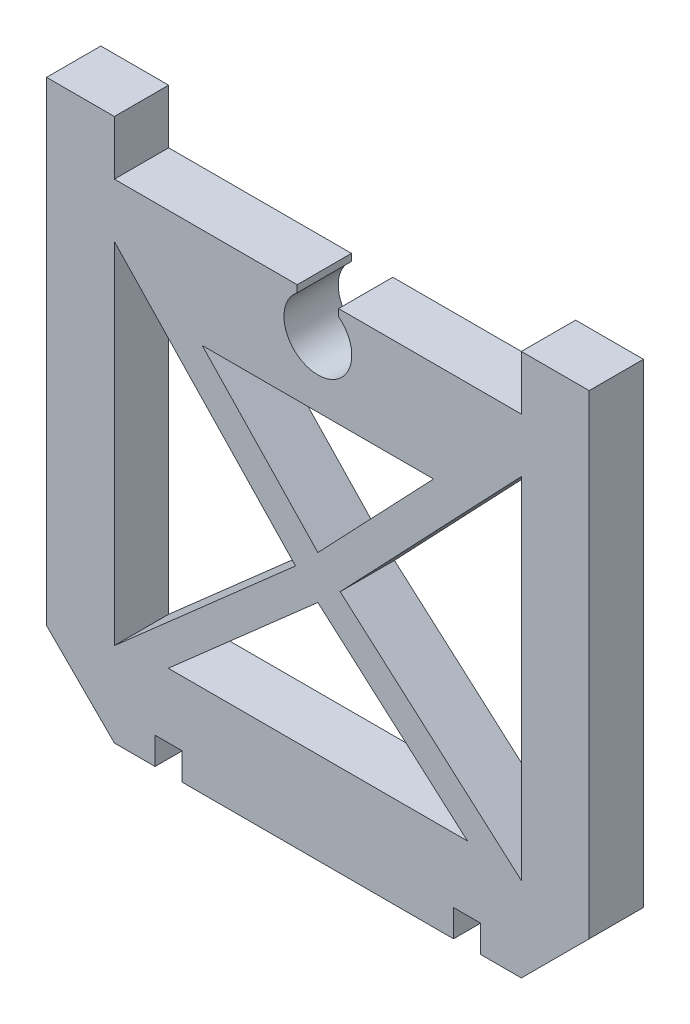
ISO-10303-21;
HEADER;
FILE_DESCRIPTION(('STEP AP214'),'2;1');
FILE_NAME('part.step','',(''),(''),'','','');
FILE_SCHEMA(('AUTOMOTIVE_DESIGN { 1 0 10303 214 1 1 1 1 }'));
ENDSEC;
DATA;
#1=APPLICATION_CONTEXT('core data for automotive mechanical design processes');
#2=APPLICATION_PROTOCOL_DEFINITION('international standard','automotive_design',2000,#1);
#3=PRODUCT_CONTEXT('',#1,'mechanical');
#4=PRODUCT('Part','Part','',(#3));
#5=PRODUCT_RELATED_PRODUCT_CATEGORY('part','',(#4));
#6=PRODUCT_DEFINITION_FORMATION('','',#4);
#7=PRODUCT_DEFINITION_CONTEXT('part definition',#1,'design');
#8=PRODUCT_DEFINITION('design','',#6,#7);
#9=PRODUCT_DEFINITION_SHAPE('','',#8);
#10=(LENGTH_UNIT() NAMED_UNIT(*) SI_UNIT(.MILLI.,.METRE.));
#11=(NAMED_UNIT(*) PLANE_ANGLE_UNIT() SI_UNIT($,.RADIAN.));
#12=(NAMED_UNIT(*) SI_UNIT($,.STERADIAN.) SOLID_ANGLE_UNIT());
#13=UNCERTAINTY_MEASURE_WITH_UNIT(LENGTH_MEASURE(1.E-05),#10,'distance_accuracy_value','');
#14=(GEOMETRIC_REPRESENTATION_CONTEXT(3) GLOBAL_UNCERTAINTY_ASSIGNED_CONTEXT((#13)) GLOBAL_UNIT_ASSIGNED_CONTEXT((#10,
#11,#12)) REPRESENTATION_CONTEXT('',''));
#15=CARTESIAN_POINT('',(0.,0.,0.));
#16=DIRECTION('',(0.,0.,1.));
#17=DIRECTION('',(1.,0.,0.));
#18=AXIS2_PLACEMENT_3D('',#15,#16,#17);
#19=CARTESIAN_POINT('',(8.61119822452986,-8.19508755901242,4.));
#20=DIRECTION('',(-0.724392200156808,0.689388091246128,0.));
#21=DIRECTION('',(-0.689388091246128,-0.724392200156808,0.));
#22=AXIS2_PLACEMENT_3D('',#19,#20,#21);
#23=PLANE('',#22);
#24=DIRECTION('',(0.689388091246128,0.724392200156808,0.));
#25=VECTOR('',#24,1.);
#26=CARTESIAN_POINT('',(8.61119822452986,-8.19508755901242,0.));
#27=LINE('',#26,#25);
#28=CARTESIAN_POINT('',(1.64320660269983,-15.5168832872905,0.));
#29=VERTEX_POINT('',#28);
#30=CARTESIAN_POINT('',(15.,-1.48189040161298,0.));
#31=VERTEX_POINT('',#30);
#32=EDGE_CURVE('E283',#29,#31,#27,.T.);
#33=ORIENTED_EDGE('',*,*,#32,.T.);
#34=DIRECTION('',(0.,0.,-1.));
#35=VECTOR('',#34,1.);
#36=CARTESIAN_POINT('',(15.,-1.48189040161298,4.));
#37=LINE('',#36,#35);
#38=CARTESIAN_POINT('',(15.,-1.48189040161298,4.));
#39=VERTEX_POINT('',#38);
#40=EDGE_CURVE('E11',#39,#31,#37,.T.);
#41=ORIENTED_EDGE('',*,*,#40,.F.);
#42=DIRECTION('',(0.689388091246128,0.724392200156808,0.));
#43=VECTOR('',#42,1.);
#44=CARTESIAN_POINT('',(8.61119822452986,-8.19508755901242,4.));
#45=LINE('',#44,#43);
#46=CARTESIAN_POINT('',(1.64320660269983,-15.5168832872905,4.));
#47=VERTEX_POINT('',#46);
#48=EDGE_CURVE('E274',#47,#39,#45,.T.);
#49=ORIENTED_EDGE('',*,*,#48,.F.);
#50=DIRECTION('',(0.,0.,-1.));
#51=VECTOR('',#50,1.);
#52=CARTESIAN_POINT('',(1.64320660269983,-15.5168832872905,4.));
#53=LINE('',#52,#51);
#54=EDGE_CURVE('E284',#47,#29,#53,.T.);
#55=ORIENTED_EDGE('',*,*,#54,.T.);
#56=EDGE_LOOP('',(#33,#41,#49,#55));
#57=FACE_BOUND('',#56,.T.);
#58=ADVANCED_FACE('F39',(#57),#23,.F.);
#59=CARTESIAN_POINT('',(15.,0.,4.));
#60=DIRECTION('',(1.,0.,0.));
#61=DIRECTION('',(0.,0.,-1.));
#62=AXIS2_PLACEMENT_3D('',#59,#60,#61);
#63=PLANE('',#62);
#64=DIRECTION('',(0.,-1.,0.));
#65=VECTOR('',#64,1.);
#66=CARTESIAN_POINT('',(15.,0.,0.));
#67=LINE('',#66,#65);
#68=CARTESIAN_POINT('',(15.,-27.2797465702889,0.));
#69=VERTEX_POINT('',#68);
#70=EDGE_CURVE('E164',#31,#69,#67,.T.);
#71=ORIENTED_EDGE('',*,*,#70,.T.);
#72=DIRECTION('',(0.,0.,-1.));
#73=VECTOR('',#72,1.);
#74=CARTESIAN_POINT('',(15.,-27.2797465702889,4.));
#75=LINE('',#74,#73);
#76=CARTESIAN_POINT('',(15.,-27.2797465702889,4.));
#77=VERTEX_POINT('',#76);
#78=EDGE_CURVE('E50',#77,#69,#75,.T.);
#79=ORIENTED_EDGE('',*,*,#78,.F.);
#80=DIRECTION('',(0.,-1.,0.));
#81=VECTOR('',#80,1.);
#82=CARTESIAN_POINT('',(15.,0.,4.));
#83=LINE('',#82,#81);
#84=EDGE_CURVE('E269',#39,#77,#83,.T.);
#85=ORIENTED_EDGE('',*,*,#84,.F.);
#86=ORIENTED_EDGE('',*,*,#40,.T.);
#87=EDGE_LOOP('',(#71,#79,#85,#86));
#88=FACE_BOUND('',#87,.T.);
#89=ADVANCED_FACE('F270',(#88),#63,.F.);
#90=CARTESIAN_POINT('',(0.,-4.88041037592957,4.));
#91=DIRECTION('',(0.,-1.,0.));
#92=DIRECTION('',(0.,0.,-1.));
#93=AXIS2_PLACEMENT_3D('',#90,#91,#92);
#94=PLANE('',#93);
#95=DIRECTION('',(-1.,0.,0.));
#96=VECTOR('',#95,1.);
#97=CARTESIAN_POINT('',(0.,-4.88041037592957,0.));
#98=LINE('',#97,#96);
#99=CARTESIAN_POINT('',(8.52612899605196,-4.88041037592957,0.));
#100=VERTEX_POINT('',#99);
#101=CARTESIAN_POINT('',(-8.52612899605196,-4.88041037592957,0.));
#102=VERTEX_POINT('',#101);
#103=EDGE_CURVE('E517',#100,#102,#98,.T.);
#104=ORIENTED_EDGE('',*,*,#103,.F.);
#105=DIRECTION('',(0.,0.,-1.));
#106=VECTOR('',#105,1.);
#107=CARTESIAN_POINT('',(8.52612899605196,-4.88041037592957,4.));
#108=LINE('',#107,#106);
#109=CARTESIAN_POINT('',(8.52612899605196,-4.88041037592957,4.));
#110=VERTEX_POINT('',#109);
#111=EDGE_CURVE('E302',#110,#100,#108,.T.);
#112=ORIENTED_EDGE('',*,*,#111,.F.);
#113=DIRECTION('',(-1.,0.,0.));
#114=VECTOR('',#113,1.);
#115=CARTESIAN_POINT('',(0.,-4.88041037592957,4.));
#116=LINE('',#115,#114);
#117=CARTESIAN_POINT('',(-8.52612899605196,-4.88041037592957,4.));
#118=VERTEX_POINT('',#117);
#119=EDGE_CURVE('E541',#110,#118,#116,.T.);
#120=ORIENTED_EDGE('',*,*,#119,.T.);
#121=DIRECTION('',(0.,0.,-1.));
#122=VECTOR('',#121,1.);
#123=CARTESIAN_POINT('',(-8.52612899605196,-4.88041037592957,4.));
#124=LINE('',#123,#122);
#125=EDGE_CURVE('E305',#118,#102,#124,.T.);
#126=ORIENTED_EDGE('',*,*,#125,.T.);
#127=EDGE_LOOP('',(#104,#112,#120,#126));
#128=FACE_BOUND('',#127,.T.);
#129=ADVANCED_FACE('F745',(#128),#94,.T.);
#130=CARTESIAN_POINT('',(6.91125077717837,-6.5772850403013,4.));
#131=DIRECTION('',(0.724392200156807,-0.689388091246128,0.));
#132=DIRECTION('',(0.689388091246128,0.724392200156807,0.));
#133=AXIS2_PLACEMENT_3D('',#130,#131,#132);
#134=PLANE('',#133);
#135=DIRECTION('',(-0.689388091246128,-0.724392200156807,0.));
#136=VECTOR('',#135,1.);
#137=CARTESIAN_POINT('',(6.91125077717837,-6.5772850403013,0.));
#138=LINE('',#137,#136);
#139=CARTESIAN_POINT('',(0.,-13.8394588722659,0.));
#140=VERTEX_POINT('',#139);
#141=EDGE_CURVE('E293',#100,#140,#138,.T.);
#142=ORIENTED_EDGE('',*,*,#141,.T.);
#143=DIRECTION('',(0.,0.,-1.));
#144=VECTOR('',#143,1.);
#145=CARTESIAN_POINT('',(0.,-13.8394588722659,4.));
#146=LINE('',#145,#144);
#147=CARTESIAN_POINT('',(0.,-13.8394588722659,4.));
#148=VERTEX_POINT('',#147);
#149=EDGE_CURVE('E308',#148,#140,#146,.T.);
#150=ORIENTED_EDGE('',*,*,#149,.F.);
#151=DIRECTION('',(-0.689388091246128,-0.724392200156807,0.));
#152=VECTOR('',#151,1.);
#153=CARTESIAN_POINT('',(6.91125077717837,-6.5772850403013,4.));
#154=LINE('',#153,#152);
#155=EDGE_CURVE('E538',#110,#148,#154,.T.);
#156=ORIENTED_EDGE('',*,*,#155,.F.);
#157=ORIENTED_EDGE('',*,*,#111,.T.);
#158=EDGE_LOOP('',(#142,#150,#156,#157));
#159=FACE_BOUND('',#158,.T.);
#160=ADVANCED_FACE('F525',(#159),#134,.F.);
#161=CARTESIAN_POINT('',(8.44480258001715,-9.5891179408084,4.));
#162=DIRECTION('',(0.6609091935049,-0.750465880597315,0.));
#163=DIRECTION('',(0.750465880597315,0.6609091935049,0.));
#164=AXIS2_PLACEMENT_3D('',#161,#162,#163);
#165=PLANE('',#164);
#166=DIRECTION('',(-0.750465880597315,-0.6609091935049,0.));
#167=VECTOR('',#166,1.);
#168=CARTESIAN_POINT('',(8.44480258001715,-9.5891179408084,0.));
#169=LINE('',#168,#167);
#170=CARTESIAN_POINT('',(0.,-17.0261617915228,0.));
#171=VERTEX_POINT('',#170);
#172=CARTESIAN_POINT('',(-11.0290619170497,-26.7390729380112,0.));
#173=VERTEX_POINT('',#172);
#174=EDGE_CURVE('E505',#171,#173,#169,.T.);
#175=ORIENTED_EDGE('',*,*,#174,.F.);
#176=DIRECTION('',(0.,0.,-1.));
#177=VECTOR('',#176,1.);
#178=CARTESIAN_POINT('',(0.,-17.0261617915228,4.));
#179=LINE('',#178,#177);
#180=CARTESIAN_POINT('',(0.,-17.0261617915228,4.));
#181=VERTEX_POINT('',#180);
#182=EDGE_CURVE('E309',#181,#171,#179,.T.);
#183=ORIENTED_EDGE('',*,*,#182,.F.);
#184=DIRECTION('',(-0.750465880597315,-0.6609091935049,0.));
#185=VECTOR('',#184,1.);
#186=CARTESIAN_POINT('',(8.44480258001715,-9.5891179408084,4.));
#187=LINE('',#186,#185);
#188=CARTESIAN_POINT('',(-11.0290619170497,-26.7390729380112,4.));
#189=VERTEX_POINT('',#188);
#190=EDGE_CURVE('E554',#181,#189,#187,.T.);
#191=ORIENTED_EDGE('',*,*,#190,.T.);
#192=DIRECTION('',(0.,0.,-1.));
#193=VECTOR('',#192,1.);
#194=CARTESIAN_POINT('',(-11.0290619170497,-26.7390729380112,4.));
#195=LINE('',#194,#193);
#196=EDGE_CURVE('E314',#189,#173,#195,.T.);
#197=ORIENTED_EDGE('',*,*,#196,.T.);
#198=EDGE_LOOP('',(#175,#183,#191,#197));
#199=FACE_BOUND('',#198,.T.);
#200=ADVANCED_FACE('F754',(#199),#165,.T.);
#201=CARTESIAN_POINT('',(-8.44480258001715,-9.5891179408084,4.));
#202=DIRECTION('',(0.6609091935049,0.750465880597315,0.));
#203=DIRECTION('',(-0.750465880597315,0.6609091935049,0.));
#204=AXIS2_PLACEMENT_3D('',#201,#202,#203);
#205=PLANE('',#204);
#206=DIRECTION('',(0.750465880597315,-0.6609091935049,0.));
#207=VECTOR('',#206,1.);
#208=CARTESIAN_POINT('',(-8.44480258001715,-9.5891179408084,0.));
#209=LINE('',#208,#207);
#210=CARTESIAN_POINT('',(11.0290619170497,-26.7390729380112,0.));
#211=VERTEX_POINT('',#210);
#212=EDGE_CURVE('E509',#171,#211,#209,.T.);
#213=ORIENTED_EDGE('',*,*,#212,.T.);
#214=DIRECTION('',(0.,0.,-1.));
#215=VECTOR('',#214,1.);
#216=CARTESIAN_POINT('',(11.0290619170497,-26.7390729380112,4.));
#217=LINE('',#216,#215);
#218=CARTESIAN_POINT('',(11.0290619170497,-26.7390729380112,4.));
#219=VERTEX_POINT('',#218);
#220=EDGE_CURVE('E317',#219,#211,#217,.T.);
#221=ORIENTED_EDGE('',*,*,#220,.F.);
#222=DIRECTION('',(0.750465880597315,-0.6609091935049,0.));
#223=VECTOR('',#222,1.);
#224=CARTESIAN_POINT('',(-8.44480258001715,-9.5891179408084,4.));
#225=LINE('',#224,#223);
#226=EDGE_CURVE('E551',#181,#219,#225,.T.);
#227=ORIENTED_EDGE('',*,*,#226,.F.);
#228=ORIENTED_EDGE('',*,*,#182,.T.);
#229=EDGE_LOOP('',(#213,#221,#227,#228));
#230=FACE_BOUND('',#229,.T.);
#231=ADVANCED_FACE('F762',(#230),#205,.F.);
#232=CARTESIAN_POINT('',(-8.61119822452986,-8.19508755901242,4.));
#233=DIRECTION('',(-0.724392200156808,-0.689388091246128,0.));
#234=DIRECTION('',(0.689388091246128,-0.724392200156808,0.));
#235=AXIS2_PLACEMENT_3D('',#232,#233,#234);
#236=PLANE('',#235);
#237=DIRECTION('',(-0.689388091246128,0.724392200156808,0.));
#238=VECTOR('',#237,1.);
#239=CARTESIAN_POINT('',(-8.61119822452986,-8.19508755901242,0.));
#240=LINE('',#239,#238);
#241=CARTESIAN_POINT('',(-1.64320660269983,-15.5168832872905,0.));
#242=VERTEX_POINT('',#241);
#243=CARTESIAN_POINT('',(-15.,-1.48189040161298,0.));
#244=VERTEX_POINT('',#243);
#245=EDGE_CURVE('E493',#242,#244,#240,.T.);
#246=ORIENTED_EDGE('',*,*,#245,.F.);
#247=DIRECTION('',(0.,0.,-1.));
#248=VECTOR('',#247,1.);
#249=CARTESIAN_POINT('',(-1.64320660269983,-15.5168832872905,4.));
#250=LINE('',#249,#248);
#251=CARTESIAN_POINT('',(-1.64320660269983,-15.5168832872905,4.));
#252=VERTEX_POINT('',#251);
#253=EDGE_CURVE('E318',#252,#242,#250,.T.);
#254=ORIENTED_EDGE('',*,*,#253,.F.);
#255=DIRECTION('',(-0.689388091246128,0.724392200156808,0.));
#256=VECTOR('',#255,1.);
#257=CARTESIAN_POINT('',(-8.61119822452986,-8.19508755901242,4.));
#258=LINE('',#257,#256);
#259=CARTESIAN_POINT('',(-15.,-1.48189040161298,4.));
#260=VERTEX_POINT('',#259);
#261=EDGE_CURVE('E566',#252,#260,#258,.T.);
#262=ORIENTED_EDGE('',*,*,#261,.T.);
#263=DIRECTION('',(0.,0.,-1.));
#264=VECTOR('',#263,1.);
#265=CARTESIAN_POINT('',(-15.,-1.48189040161298,4.));
#266=LINE('',#265,#264);
#267=EDGE_CURVE('E323',#260,#244,#266,.T.);
#268=ORIENTED_EDGE('',*,*,#267,.T.);
#269=EDGE_LOOP('',(#246,#254,#262,#268));
#270=FACE_BOUND('',#269,.T.);
#271=ADVANCED_FACE('F765',(#270),#236,.T.);
#272=CARTESIAN_POINT('',(6.97846161179035,-7.92408002517517,4.));
#273=DIRECTION('',(-0.660909193504899,0.750465880597315,0.));
#274=DIRECTION('',(-0.750465880597315,-0.660909193504899,0.));
#275=AXIS2_PLACEMENT_3D('',#272,#273,#274);
#276=PLANE('',#275);
#277=DIRECTION('',(0.750465880597315,0.660909193504899,0.));
#278=VECTOR('',#277,1.);
#279=CARTESIAN_POINT('',(6.97846161179035,-7.92408002517517,0.));
#280=LINE('',#279,#278);
#281=CARTESIAN_POINT('',(-15.,-27.2797465702889,0.));
#282=VERTEX_POINT('',#281);
#283=EDGE_CURVE('E497',#282,#242,#280,.T.);
#284=ORIENTED_EDGE('',*,*,#283,.F.);
#285=DIRECTION('',(0.,0.,-1.));
#286=VECTOR('',#285,1.);
#287=CARTESIAN_POINT('',(-15.,-27.2797465702889,4.));
#288=LINE('',#287,#286);
#289=CARTESIAN_POINT('',(-15.,-27.2797465702889,4.));
#290=VERTEX_POINT('',#289);
#291=EDGE_CURVE('E326',#290,#282,#288,.T.);
#292=ORIENTED_EDGE('',*,*,#291,.F.);
#293=DIRECTION('',(0.750465880597315,0.660909193504899,0.));
#294=VECTOR('',#293,1.);
#295=CARTESIAN_POINT('',(6.97846161179035,-7.92408002517517,4.));
#296=LINE('',#295,#294);
#297=EDGE_CURVE('E562',#290,#252,#296,.T.);
#298=ORIENTED_EDGE('',*,*,#297,.T.);
#299=ORIENTED_EDGE('',*,*,#253,.T.);
#300=EDGE_LOOP('',(#284,#292,#298,#299));
#301=FACE_BOUND('',#300,.T.);
#302=ADVANCED_FACE('F773',(#301),#276,.T.);
#303=CARTESIAN_POINT('',(0.,0.,4.));
#304=DIRECTION('',(0.,0.,-1.));
#305=DIRECTION('',(-1.,0.,0.));
#306=AXIS2_PLACEMENT_3D('',#303,#304,#305);
#307=CYLINDRICAL_SURFACE('',#306,2.5);
#308=CARTESIAN_POINT('',(0.,0.,0.));
#309=DIRECTION('',(0.,0.,1.));
#310=DIRECTION('',(1.,0.,0.));
#311=AXIS2_PLACEMENT_3D('',#308,#309,#310);
#312=CIRCLE('',#311,2.5);
#313=CARTESIAN_POINT('',(-1.52347167103858,1.98217912095323,0.));
#314=VERTEX_POINT('',#313);
#315=CARTESIAN_POINT('',(1.52347167103858,1.98217912095323,0.));
#316=VERTEX_POINT('',#315);
#317=EDGE_CURVE('E415',#314,#316,#312,.T.);
#318=ORIENTED_EDGE('',*,*,#317,.F.);
#319=DIRECTION('',(0.,0.,-1.));
#320=VECTOR('',#319,1.);
#321=CARTESIAN_POINT('',(-1.52347167103858,1.98217912095323,4.));
#322=LINE('',#321,#320);
#323=CARTESIAN_POINT('',(-1.52347167103858,1.98217912095323,4.));
#324=VERTEX_POINT('',#323);
#325=EDGE_CURVE('E43',#324,#314,#322,.T.);
#326=ORIENTED_EDGE('',*,*,#325,.F.);
#327=CARTESIAN_POINT('',(0.,0.,4.));
#328=DIRECTION('',(0.,0.,1.));
#329=DIRECTION('',(1.,0.,0.));
#330=AXIS2_PLACEMENT_3D('',#327,#328,#329);
#331=CIRCLE('',#330,2.5);
#332=CARTESIAN_POINT('',(1.52347167103858,1.98217912095323,4.));
#333=VERTEX_POINT('',#332);
#334=EDGE_CURVE('E299',#324,#333,#331,.T.);
#335=ORIENTED_EDGE('',*,*,#334,.T.);
#336=DIRECTION('',(0.,0.,-1.));
#337=VECTOR('',#336,1.);
#338=CARTESIAN_POINT('',(1.52347167103858,1.98217912095323,4.));
#339=LINE('',#338,#337);
#340=EDGE_CURVE('E331',#333,#316,#339,.T.);
#341=ORIENTED_EDGE('',*,*,#340,.T.);
#342=EDGE_LOOP('',(#318,#326,#335,#341));
#343=FACE_BOUND('',#342,.T.);
#344=ADVANCED_FACE('F41',(#343),#307,.F.);
#345=CARTESIAN_POINT('',(-1.52347167103858,0.,4.));
#346=DIRECTION('',(1.,0.,0.));
#347=DIRECTION('',(0.,0.,-1.));
#348=AXIS2_PLACEMENT_3D('',#345,#346,#347);
#349=PLANE('',#348);
#350=DIRECTION('',(0.,-1.,0.));
#351=VECTOR('',#350,1.);
#352=CARTESIAN_POINT('',(-1.52347167103858,0.,0.));
#353=LINE('',#352,#351);
#354=CARTESIAN_POINT('',(-1.52347167103858,2.5,0.));
#355=VERTEX_POINT('',#354);
#356=EDGE_CURVE('E411',#355,#314,#353,.T.);
#357=ORIENTED_EDGE('',*,*,#356,.F.);
#358=DIRECTION('',(0.,0.,-1.));
#359=VECTOR('',#358,1.);
#360=CARTESIAN_POINT('',(-1.52347167103858,2.5,4.));
#361=LINE('',#360,#359);
#362=CARTESIAN_POINT('',(-1.52347167103858,2.5,4.));
#363=VERTEX_POINT('',#362);
#364=EDGE_CURVE('E400',#363,#355,#361,.T.);
#365=ORIENTED_EDGE('',*,*,#364,.F.);
#366=DIRECTION('',(0.,-1.,0.));
#367=VECTOR('',#366,1.);
#368=CARTESIAN_POINT('',(-1.52347167103858,0.,4.));
#369=LINE('',#368,#367);
#370=EDGE_CURVE('E413',#363,#324,#369,.T.);
#371=ORIENTED_EDGE('',*,*,#370,.T.);
#372=ORIENTED_EDGE('',*,*,#325,.T.);
#373=EDGE_LOOP('',(#357,#365,#371,#372));
#374=FACE_BOUND('',#373,.T.);
#375=ADVANCED_FACE('F409',(#374),#349,.T.);
#376=CARTESIAN_POINT('',(0.,2.5,4.));
#377=DIRECTION('',(0.,-1.,0.));
#378=DIRECTION('',(0.,0.,-1.));
#379=AXIS2_PLACEMENT_3D('',#376,#377,#378);
#380=PLANE('',#379);
#381=DIRECTION('',(-1.,0.,0.));
#382=VECTOR('',#381,1.);
#383=CARTESIAN_POINT('',(0.,2.5,0.));
#384=LINE('',#383,#382);
#385=CARTESIAN_POINT('',(-15.,2.5,0.));
#386=VERTEX_POINT('',#385);
#387=EDGE_CURVE('E425',#355,#386,#384,.T.);
#388=ORIENTED_EDGE('',*,*,#387,.T.);
#389=DIRECTION('',(0.,0.,-1.));
#390=VECTOR('',#389,1.);
#391=CARTESIAN_POINT('',(-15.,2.5,4.));
#392=LINE('',#391,#390);
#393=CARTESIAN_POINT('',(-15.,2.5,4.));
#394=VERTEX_POINT('',#393);
#395=EDGE_CURVE('E397',#394,#386,#392,.T.);
#396=ORIENTED_EDGE('',*,*,#395,.F.);
#397=DIRECTION('',(-1.,0.,0.));
#398=VECTOR('',#397,1.);
#399=CARTESIAN_POINT('',(0.,2.5,4.));
#400=LINE('',#399,#398);
#401=EDGE_CURVE('E631',#363,#394,#400,.T.);
#402=ORIENTED_EDGE('',*,*,#401,.F.);
#403=ORIENTED_EDGE('',*,*,#364,.T.);
#404=EDGE_LOOP('',(#388,#396,#402,#403));
#405=FACE_BOUND('',#404,.T.);
#406=ADVANCED_FACE('F726',(#405),#380,.F.);
#407=CARTESIAN_POINT('',(-15.,0.,4.));
#408=DIRECTION('',(-1.,0.,0.));
#409=DIRECTION('',(0.,0.,1.));
#410=AXIS2_PLACEMENT_3D('',#407,#408,#409);
#411=PLANE('',#410);
#412=DIRECTION('',(0.,1.,0.));
#413=VECTOR('',#412,1.);
#414=CARTESIAN_POINT('',(-15.,0.,0.));
#415=LINE('',#414,#413);
#416=CARTESIAN_POINT('',(-15.,6.5,0.));
#417=VERTEX_POINT('',#416);
#418=EDGE_CURVE('E429',#386,#417,#415,.T.);
#419=ORIENTED_EDGE('',*,*,#418,.T.);
#420=DIRECTION('',(0.,0.,-1.));
#421=VECTOR('',#420,1.);
#422=CARTESIAN_POINT('',(-15.,6.5,4.));
#423=LINE('',#422,#421);
#424=CARTESIAN_POINT('',(-15.,6.5,4.));
#425=VERTEX_POINT('',#424);
#426=EDGE_CURVE('E393',#425,#417,#423,.T.);
#427=ORIENTED_EDGE('',*,*,#426,.F.);
#428=DIRECTION('',(0.,1.,0.));
#429=VECTOR('',#428,1.);
#430=CARTESIAN_POINT('',(-15.,0.,4.));
#431=LINE('',#430,#429);
#432=EDGE_CURVE('E628',#394,#425,#431,.T.);
#433=ORIENTED_EDGE('',*,*,#432,.F.);
#434=ORIENTED_EDGE('',*,*,#395,.T.);
#435=EDGE_LOOP('',(#419,#427,#433,#434));
#436=FACE_BOUND('',#435,.T.);
#437=ADVANCED_FACE('F724',(#436),#411,.F.);
#438=CARTESIAN_POINT('',(0.,6.5,4.));
#439=DIRECTION('',(0.,-1.,0.));
#440=DIRECTION('',(0.,0.,-1.));
#441=AXIS2_PLACEMENT_3D('',#438,#439,#440);
#442=PLANE('',#441);
#443=DIRECTION('',(-1.,0.,0.));
#444=VECTOR('',#443,1.);
#445=CARTESIAN_POINT('',(0.,6.5,0.));
#446=LINE('',#445,#444);
#447=CARTESIAN_POINT('',(-20.,6.5,0.));
#448=VERTEX_POINT('',#447);
#449=EDGE_CURVE('E436',#417,#448,#446,.T.);
#450=ORIENTED_EDGE('',*,*,#449,.T.);
#451=DIRECTION('',(0.,0.,-1.));
#452=VECTOR('',#451,1.);
#453=CARTESIAN_POINT('',(-20.,6.5,4.));
#454=LINE('',#453,#452);
#455=CARTESIAN_POINT('',(-20.,6.5,4.));
#456=VERTEX_POINT('',#455);
#457=EDGE_CURVE('E389',#456,#448,#454,.T.);
#458=ORIENTED_EDGE('',*,*,#457,.F.);
#459=DIRECTION('',(-1.,0.,0.));
#460=VECTOR('',#459,1.);
#461=CARTESIAN_POINT('',(0.,6.5,4.));
#462=LINE('',#461,#460);
#463=EDGE_CURVE('E625',#425,#456,#462,.T.);
#464=ORIENTED_EDGE('',*,*,#463,.F.);
#465=ORIENTED_EDGE('',*,*,#426,.T.);
#466=EDGE_LOOP('',(#450,#458,#464,#465));
#467=FACE_BOUND('',#466,.T.);
#468=ADVANCED_FACE('F720',(#467),#442,.F.);
#469=CARTESIAN_POINT('',(-20.,0.,4.));
#470=DIRECTION('',(1.,0.,0.));
#471=DIRECTION('',(0.,1.,0.));
#472=AXIS2_PLACEMENT_3D('',#469,#470,#471);
#473=PLANE('',#472);
#474=DIRECTION('',(0.,-1.,0.));
#475=VECTOR('',#474,1.);
#476=CARTESIAN_POINT('',(-20.,0.,0.));
#477=LINE('',#476,#475);
#478=CARTESIAN_POINT('',(-20.,-28.5,0.));
#479=VERTEX_POINT('',#478);
#480=EDGE_CURVE('E439',#448,#479,#477,.T.);
#481=ORIENTED_EDGE('',*,*,#480,.T.);
#482=DIRECTION('',(0.,0.,-1.));
#483=VECTOR('',#482,1.);
#484=CARTESIAN_POINT('',(-20.,-28.5,4.));
#485=LINE('',#484,#483);
#486=CARTESIAN_POINT('',(-20.,-28.5,4.));
#487=VERTEX_POINT('',#486);
#488=EDGE_CURVE('E385',#487,#479,#485,.T.);
#489=ORIENTED_EDGE('',*,*,#488,.F.);
#490=DIRECTION('',(0.,-1.,0.));
#491=VECTOR('',#490,1.);
#492=CARTESIAN_POINT('',(-20.,0.,4.));
#493=LINE('',#492,#491);
#494=EDGE_CURVE('E622',#456,#487,#493,.T.);
#495=ORIENTED_EDGE('',*,*,#494,.F.);
#496=ORIENTED_EDGE('',*,*,#457,.T.);
#497=EDGE_LOOP('',(#481,#489,#495,#496));
#498=FACE_BOUND('',#497,.T.);
#499=ADVANCED_FACE('F715',(#498),#473,.F.);
#500=CARTESIAN_POINT('',(-24.25,-24.2500000000001,4.));
#501=DIRECTION('',(0.707106781186546,0.707106781186549,0.));
#502=DIRECTION('',(-0.707106781186549,0.707106781186546,0.));
#503=AXIS2_PLACEMENT_3D('',#500,#501,#502);
#504=PLANE('',#503);
#505=DIRECTION('',(0.707106781186549,-0.707106781186546,0.));
#506=VECTOR('',#505,1.);
#507=CARTESIAN_POINT('',(-24.25,-24.2500000000001,0.));
#508=LINE('',#507,#506);
#509=CARTESIAN_POINT('',(-15.,-33.5,0.));
#510=VERTEX_POINT('',#509);
#511=EDGE_CURVE('E442',#479,#510,#508,.T.);
#512=ORIENTED_EDGE('',*,*,#511,.T.);
#513=DIRECTION('',(0.,0.,-1.));
#514=VECTOR('',#513,1.);
#515=CARTESIAN_POINT('',(-15.,-33.5,4.));
#516=LINE('',#515,#514);
#517=CARTESIAN_POINT('',(-15.,-33.5,4.));
#518=VERTEX_POINT('',#517);
#519=EDGE_CURVE('E381',#518,#510,#516,.T.);
#520=ORIENTED_EDGE('',*,*,#519,.F.);
#521=DIRECTION('',(0.707106781186549,-0.707106781186546,0.));
#522=VECTOR('',#521,1.);
#523=CARTESIAN_POINT('',(-24.25,-24.2500000000001,4.));
#524=LINE('',#523,#522);
#525=EDGE_CURVE('E619',#487,#518,#524,.T.);
#526=ORIENTED_EDGE('',*,*,#525,.F.);
#527=ORIENTED_EDGE('',*,*,#488,.T.);
#528=EDGE_LOOP('',(#512,#520,#526,#527));
#529=FACE_BOUND('',#528,.T.);
#530=ADVANCED_FACE('F710',(#529),#504,.F.);
#531=CARTESIAN_POINT('',(0.,-33.5,4.));
#532=DIRECTION('',(0.,1.,0.));
#533=DIRECTION('',(0.,0.,1.));
#534=AXIS2_PLACEMENT_3D('',#531,#532,#533);
#535=PLANE('',#534);
#536=DIRECTION('',(1.,0.,0.));
#537=VECTOR('',#536,1.);
#538=CARTESIAN_POINT('',(0.,-33.5,0.));
#539=LINE('',#538,#537);
#540=CARTESIAN_POINT('',(-12.,-33.5,0.));
#541=VERTEX_POINT('',#540);
#542=EDGE_CURVE('E445',#510,#541,#539,.T.);
#543=ORIENTED_EDGE('',*,*,#542,.T.);
#544=DIRECTION('',(0.,0.,-1.));
#545=VECTOR('',#544,1.);
#546=CARTESIAN_POINT('',(-12.,-33.5,4.));
#547=LINE('',#546,#545);
#548=CARTESIAN_POINT('',(-12.,-33.5,4.));
#549=VERTEX_POINT('',#548);
#550=EDGE_CURVE('E377',#549,#541,#547,.T.);
#551=ORIENTED_EDGE('',*,*,#550,.F.);
#552=DIRECTION('',(1.,0.,0.));
#553=VECTOR('',#552,1.);
#554=CARTESIAN_POINT('',(0.,-33.5,4.));
#555=LINE('',#554,#553);
#556=EDGE_CURVE('E616',#518,#549,#555,.T.);
#557=ORIENTED_EDGE('',*,*,#556,.F.);
#558=ORIENTED_EDGE('',*,*,#519,.T.);
#559=EDGE_LOOP('',(#543,#551,#557,#558));
#560=FACE_BOUND('',#559,.T.);
#561=ADVANCED_FACE('F706',(#560),#535,.F.);
#562=CARTESIAN_POINT('',(-12.,0.,4.));
#563=DIRECTION('',(-1.,0.,0.));
#564=DIRECTION('',(0.,0.,1.));
#565=AXIS2_PLACEMENT_3D('',#562,#563,#564);
#566=PLANE('',#565);
#567=DIRECTION('',(0.,1.,0.));
#568=VECTOR('',#567,1.);
#569=CARTESIAN_POINT('',(-12.,0.,0.));
#570=LINE('',#569,#568);
#571=CARTESIAN_POINT('',(-12.,-31.5,0.));
#572=VERTEX_POINT('',#571);
#573=EDGE_CURVE('E448',#541,#572,#570,.T.);
#574=ORIENTED_EDGE('',*,*,#573,.T.);
#575=DIRECTION('',(0.,0.,-1.));
#576=VECTOR('',#575,1.);
#577=CARTESIAN_POINT('',(-12.,-31.5,4.));
#578=LINE('',#577,#576);
#579=CARTESIAN_POINT('',(-12.,-31.5,4.));
#580=VERTEX_POINT('',#579);
#581=EDGE_CURVE('E373',#580,#572,#578,.T.);
#582=ORIENTED_EDGE('',*,*,#581,.F.);
#583=DIRECTION('',(0.,1.,0.));
#584=VECTOR('',#583,1.);
#585=CARTESIAN_POINT('',(-12.,0.,4.));
#586=LINE('',#585,#584);
#587=EDGE_CURVE('E613',#549,#580,#586,.T.);
#588=ORIENTED_EDGE('',*,*,#587,.F.);
#589=ORIENTED_EDGE('',*,*,#550,.T.);
#590=EDGE_LOOP('',(#574,#582,#588,#589));
#591=FACE_BOUND('',#590,.T.);
#592=ADVANCED_FACE('F701',(#591),#566,.F.);
#593=CARTESIAN_POINT('',(0.,-31.5,4.));
#594=DIRECTION('',(0.,1.,0.));
#595=DIRECTION('',(0.,0.,1.));
#596=AXIS2_PLACEMENT_3D('',#593,#594,#595);
#597=PLANE('',#596);
#598=DIRECTION('',(1.,0.,0.));
#599=VECTOR('',#598,1.);
#600=CARTESIAN_POINT('',(0.,-31.5,0.));
#601=LINE('',#600,#599);
#602=CARTESIAN_POINT('',(-10.,-31.5,0.));
#603=VERTEX_POINT('',#602);
#604=EDGE_CURVE('E452',#572,#603,#601,.T.);
#605=ORIENTED_EDGE('',*,*,#604,.T.);
#606=DIRECTION('',(0.,0.,-1.));
#607=VECTOR('',#606,1.);
#608=CARTESIAN_POINT('',(-10.,-31.5,4.));
#609=LINE('',#608,#607);
#610=CARTESIAN_POINT('',(-10.,-31.5,4.));
#611=VERTEX_POINT('',#610);
#612=EDGE_CURVE('E369',#611,#603,#609,.T.);
#613=ORIENTED_EDGE('',*,*,#612,.F.);
#614=DIRECTION('',(1.,0.,0.));
#615=VECTOR('',#614,1.);
#616=CARTESIAN_POINT('',(0.,-31.5,4.));
#617=LINE('',#616,#615);
#618=EDGE_CURVE('E610',#580,#611,#617,.T.);
#619=ORIENTED_EDGE('',*,*,#618,.F.);
#620=ORIENTED_EDGE('',*,*,#581,.T.);
#621=EDGE_LOOP('',(#605,#613,#619,#620));
#622=FACE_BOUND('',#621,.T.);
#623=ADVANCED_FACE('F695',(#622),#597,.F.);
#624=CARTESIAN_POINT('',(-10.,0.,4.));
#625=DIRECTION('',(1.,0.,0.));
#626=DIRECTION('',(0.,0.,-1.));
#627=AXIS2_PLACEMENT_3D('',#624,#625,#626);
#628=PLANE('',#627);
#629=DIRECTION('',(0.,-1.,0.));
#630=VECTOR('',#629,1.);
#631=CARTESIAN_POINT('',(-10.,0.,0.));
#632=LINE('',#631,#630);
#633=CARTESIAN_POINT('',(-10.,-33.5,0.));
#634=VERTEX_POINT('',#633);
#635=EDGE_CURVE('E455',#603,#634,#632,.T.);
#636=ORIENTED_EDGE('',*,*,#635,.T.);
#637=DIRECTION('',(0.,0.,-1.));
#638=VECTOR('',#637,1.);
#639=CARTESIAN_POINT('',(-10.,-33.5,4.));
#640=LINE('',#639,#638);
#641=CARTESIAN_POINT('',(-10.,-33.5,4.));
#642=VERTEX_POINT('',#641);
#643=EDGE_CURVE('E365',#642,#634,#640,.T.);
#644=ORIENTED_EDGE('',*,*,#643,.F.);
#645=DIRECTION('',(0.,-1.,0.));
#646=VECTOR('',#645,1.);
#647=CARTESIAN_POINT('',(-10.,0.,4.));
#648=LINE('',#647,#646);
#649=EDGE_CURVE('E607',#611,#642,#648,.T.);
#650=ORIENTED_EDGE('',*,*,#649,.F.);
#651=ORIENTED_EDGE('',*,*,#612,.T.);
#652=EDGE_LOOP('',(#636,#644,#650,#651));
#653=FACE_BOUND('',#652,.T.);
#654=ADVANCED_FACE('F691',(#653),#628,.F.);
#655=CARTESIAN_POINT('',(10.,-33.5,0.));
#656=VERTEX_POINT('',#655);
#657=EDGE_CURVE('E449',#634,#656,#539,.T.);
#658=ORIENTED_EDGE('',*,*,#657,.T.);
#659=DIRECTION('',(0.,0.,-1.));
#660=VECTOR('',#659,1.);
#661=CARTESIAN_POINT('',(10.,-33.5,4.));
#662=LINE('',#661,#660);
#663=CARTESIAN_POINT('',(10.,-33.5,4.));
#664=VERTEX_POINT('',#663);
#665=EDGE_CURVE('E362',#664,#656,#662,.T.);
#666=ORIENTED_EDGE('',*,*,#665,.F.);
#667=EDGE_CURVE('E606',#642,#664,#555,.T.);
#668=ORIENTED_EDGE('',*,*,#667,.F.);
#669=ORIENTED_EDGE('',*,*,#643,.T.);
#670=EDGE_LOOP('',(#658,#666,#668,#669));
#671=FACE_BOUND('',#670,.T.);
#672=ADVANCED_FACE('F686',(#671),#535,.F.);
#673=CARTESIAN_POINT('',(10.,0.,4.));
#674=DIRECTION('',(1.,0.,0.));
#675=DIRECTION('',(0.,0.,-1.));
#676=AXIS2_PLACEMENT_3D('',#673,#674,#675);
#677=PLANE('',#676);
#678=DIRECTION('',(0.,-1.,0.));
#679=VECTOR('',#678,1.);
#680=CARTESIAN_POINT('',(10.,0.,0.));
#681=LINE('',#680,#679);
#682=CARTESIAN_POINT('',(10.,-31.5,0.));
#683=VERTEX_POINT('',#682);
#684=EDGE_CURVE('E458',#683,#656,#681,.T.);
#685=ORIENTED_EDGE('',*,*,#684,.F.);
#686=DIRECTION('',(0.,0.,-1.));
#687=VECTOR('',#686,1.);
#688=CARTESIAN_POINT('',(10.,-31.5,4.));
#689=LINE('',#688,#687);
#690=CARTESIAN_POINT('',(10.,-31.5,4.));
#691=VERTEX_POINT('',#690);
#692=EDGE_CURVE('E359',#691,#683,#689,.T.);
#693=ORIENTED_EDGE('',*,*,#692,.F.);
#694=DIRECTION('',(0.,-1.,0.));
#695=VECTOR('',#694,1.);
#696=CARTESIAN_POINT('',(10.,0.,4.));
#697=LINE('',#696,#695);
#698=EDGE_CURVE('E602',#691,#664,#697,.T.);
#699=ORIENTED_EDGE('',*,*,#698,.T.);
#700=ORIENTED_EDGE('',*,*,#665,.T.);
#701=EDGE_LOOP('',(#685,#693,#699,#700));
#702=FACE_BOUND('',#701,.T.);
#703=ADVANCED_FACE('F678',(#702),#677,.T.);
#704=CARTESIAN_POINT('',(0.,-31.5,4.));
#705=DIRECTION('',(0.,-1.,0.));
#706=DIRECTION('',(0.,0.,-1.));
#707=AXIS2_PLACEMENT_3D('',#704,#705,#706);
#708=PLANE('',#707);
#709=DIRECTION('',(-1.,0.,0.));
#710=VECTOR('',#709,1.);
#711=CARTESIAN_POINT('',(0.,-31.5,0.));
#712=LINE('',#711,#710);
#713=CARTESIAN_POINT('',(12.,-31.5,0.));
#714=VERTEX_POINT('',#713);
#715=EDGE_CURVE('E462',#714,#683,#712,.T.);
#716=ORIENTED_EDGE('',*,*,#715,.F.);
#717=DIRECTION('',(0.,0.,-1.));
#718=VECTOR('',#717,1.);
#719=CARTESIAN_POINT('',(12.,-31.5,4.));
#720=LINE('',#719,#718);
#721=CARTESIAN_POINT('',(12.,-31.5,4.));
#722=VERTEX_POINT('',#721);
#723=EDGE_CURVE('E356',#722,#714,#720,.T.);
#724=ORIENTED_EDGE('',*,*,#723,.F.);
#725=DIRECTION('',(-1.,0.,0.));
#726=VECTOR('',#725,1.);
#727=CARTESIAN_POINT('',(0.,-31.5,4.));
#728=LINE('',#727,#726);
#729=EDGE_CURVE('E598',#722,#691,#728,.T.);
#730=ORIENTED_EDGE('',*,*,#729,.T.);
#731=ORIENTED_EDGE('',*,*,#692,.T.);
#732=EDGE_LOOP('',(#716,#724,#730,#731));
#733=FACE_BOUND('',#732,.T.);
#734=ADVANCED_FACE('F674',(#733),#708,.T.);
#735=CARTESIAN_POINT('',(12.,0.,4.));
#736=DIRECTION('',(-1.,0.,0.));
#737=DIRECTION('',(0.,0.,1.));
#738=AXIS2_PLACEMENT_3D('',#735,#736,#737);
#739=PLANE('',#738);
#740=DIRECTION('',(0.,1.,0.));
#741=VECTOR('',#740,1.);
#742=CARTESIAN_POINT('',(12.,0.,0.));
#743=LINE('',#742,#741);
#744=CARTESIAN_POINT('',(12.,-33.5,0.));
#745=VERTEX_POINT('',#744);
#746=EDGE_CURVE('E466',#745,#714,#743,.T.);
#747=ORIENTED_EDGE('',*,*,#746,.F.);
#748=DIRECTION('',(0.,0.,-1.));
#749=VECTOR('',#748,1.);
#750=CARTESIAN_POINT('',(12.,-33.5,4.));
#751=LINE('',#750,#749);
#752=CARTESIAN_POINT('',(12.,-33.5,4.));
#753=VERTEX_POINT('',#752);
#754=EDGE_CURVE('E353',#753,#745,#751,.T.);
#755=ORIENTED_EDGE('',*,*,#754,.F.);
#756=DIRECTION('',(0.,1.,0.));
#757=VECTOR('',#756,1.);
#758=CARTESIAN_POINT('',(12.,0.,4.));
#759=LINE('',#758,#757);
#760=EDGE_CURVE('E594',#753,#722,#759,.T.);
#761=ORIENTED_EDGE('',*,*,#760,.T.);
#762=ORIENTED_EDGE('',*,*,#723,.T.);
#763=EDGE_LOOP('',(#747,#755,#761,#762));
#764=FACE_BOUND('',#763,.T.);
#765=ADVANCED_FACE('F670',(#764),#739,.T.);
#766=CARTESIAN_POINT('',(0.,-33.5,4.));
#767=DIRECTION('',(0.,-1.,0.));
#768=DIRECTION('',(0.,0.,-1.));
#769=AXIS2_PLACEMENT_3D('',#766,#767,#768);
#770=PLANE('',#769);
#771=DIRECTION('',(-1.,0.,0.));
#772=VECTOR('',#771,1.);
#773=CARTESIAN_POINT('',(0.,-33.5,0.));
#774=LINE('',#773,#772);
#775=CARTESIAN_POINT('',(15.,-33.5,0.));
#776=VERTEX_POINT('',#775);
#777=EDGE_CURVE('E470',#776,#745,#774,.T.);
#778=ORIENTED_EDGE('',*,*,#777,.F.);
#779=DIRECTION('',(0.,0.,-1.));
#780=VECTOR('',#779,1.);
#781=CARTESIAN_POINT('',(15.,-33.5,4.));
#782=LINE('',#781,#780);
#783=CARTESIAN_POINT('',(15.,-33.5,4.));
#784=VERTEX_POINT('',#783);
#785=EDGE_CURVE('E350',#784,#776,#782,.T.);
#786=ORIENTED_EDGE('',*,*,#785,.F.);
#787=DIRECTION('',(-1.,0.,0.));
#788=VECTOR('',#787,1.);
#789=CARTESIAN_POINT('',(0.,-33.5,4.));
#790=LINE('',#789,#788);
#791=EDGE_CURVE('E590',#784,#753,#790,.T.);
#792=ORIENTED_EDGE('',*,*,#791,.T.);
#793=ORIENTED_EDGE('',*,*,#754,.T.);
#794=EDGE_LOOP('',(#778,#786,#792,#793));
#795=FACE_BOUND('',#794,.T.);
#796=ADVANCED_FACE('F666',(#795),#770,.T.);
#797=CARTESIAN_POINT('',(24.25,-24.2500000000001,4.));
#798=DIRECTION('',(0.707106781186546,-0.707106781186549,0.));
#799=DIRECTION('',(0.707106781186549,0.707106781186546,0.));
#800=AXIS2_PLACEMENT_3D('',#797,#798,#799);
#801=PLANE('',#800);
#802=DIRECTION('',(-0.707106781186549,-0.707106781186546,0.));
#803=VECTOR('',#802,1.);
#804=CARTESIAN_POINT('',(24.25,-24.2500000000001,0.));
#805=LINE('',#804,#803);
#806=CARTESIAN_POINT('',(20.,-28.5,0.));
#807=VERTEX_POINT('',#806);
#808=EDGE_CURVE('E474',#807,#776,#805,.T.);
#809=ORIENTED_EDGE('',*,*,#808,.F.);
#810=DIRECTION('',(0.,0.,-1.));
#811=VECTOR('',#810,1.);
#812=CARTESIAN_POINT('',(20.,-28.5,4.));
#813=LINE('',#812,#811);
#814=CARTESIAN_POINT('',(20.,-28.5,4.));
#815=VERTEX_POINT('',#814);
#816=EDGE_CURVE('E347',#815,#807,#813,.T.);
#817=ORIENTED_EDGE('',*,*,#816,.F.);
#818=DIRECTION('',(-0.707106781186549,-0.707106781186546,0.));
#819=VECTOR('',#818,1.);
#820=CARTESIAN_POINT('',(24.25,-24.2500000000001,4.));
#821=LINE('',#820,#819);
#822=EDGE_CURVE('E586',#815,#784,#821,.T.);
#823=ORIENTED_EDGE('',*,*,#822,.T.);
#824=ORIENTED_EDGE('',*,*,#785,.T.);
#825=EDGE_LOOP('',(#809,#817,#823,#824));
#826=FACE_BOUND('',#825,.T.);
#827=ADVANCED_FACE('F662',(#826),#801,.T.);
#828=CARTESIAN_POINT('',(20.,0.,4.));
#829=DIRECTION('',(1.,0.,0.));
#830=DIRECTION('',(0.,1.,0.));
#831=AXIS2_PLACEMENT_3D('',#828,#829,#830);
#832=PLANE('',#831);
#833=DIRECTION('',(0.,-1.,0.));
#834=VECTOR('',#833,1.);
#835=CARTESIAN_POINT('',(20.,0.,0.));
#836=LINE('',#835,#834);
#837=CARTESIAN_POINT('',(20.,6.5,0.));
#838=VERTEX_POINT('',#837);
#839=EDGE_CURVE('E478',#838,#807,#836,.T.);
#840=ORIENTED_EDGE('',*,*,#839,.F.);
#841=DIRECTION('',(0.,0.,-1.));
#842=VECTOR('',#841,1.);
#843=CARTESIAN_POINT('',(20.,6.5,4.));
#844=LINE('',#843,#842);
#845=CARTESIAN_POINT('',(20.,6.5,4.));
#846=VERTEX_POINT('',#845);
#847=EDGE_CURVE('E344',#846,#838,#844,.T.);
#848=ORIENTED_EDGE('',*,*,#847,.F.);
#849=DIRECTION('',(0.,-1.,0.));
#850=VECTOR('',#849,1.);
#851=CARTESIAN_POINT('',(20.,0.,4.));
#852=LINE('',#851,#850);
#853=EDGE_CURVE('E582',#846,#815,#852,.T.);
#854=ORIENTED_EDGE('',*,*,#853,.T.);
#855=ORIENTED_EDGE('',*,*,#816,.T.);
#856=EDGE_LOOP('',(#840,#848,#854,#855));
#857=FACE_BOUND('',#856,.T.);
#858=ADVANCED_FACE('F658',(#857),#832,.T.);
#859=CARTESIAN_POINT('',(0.,6.5,4.));
#860=DIRECTION('',(0.,1.,0.));
#861=DIRECTION('',(0.,0.,1.));
#862=AXIS2_PLACEMENT_3D('',#859,#860,#861);
#863=PLANE('',#862);
#864=DIRECTION('',(1.,0.,0.));
#865=VECTOR('',#864,1.);
#866=CARTESIAN_POINT('',(0.,6.5,0.));
#867=LINE('',#866,#865);
#868=CARTESIAN_POINT('',(15.,6.5,0.));
#869=VERTEX_POINT('',#868);
#870=EDGE_CURVE('E482',#869,#838,#867,.T.);
#871=ORIENTED_EDGE('',*,*,#870,.F.);
#872=DIRECTION('',(0.,0.,-1.));
#873=VECTOR('',#872,1.);
#874=CARTESIAN_POINT('',(15.,6.5,4.));
#875=LINE('',#874,#873);
#876=CARTESIAN_POINT('',(15.,6.5,4.));
#877=VERTEX_POINT('',#876);
#878=EDGE_CURVE('E341',#877,#869,#875,.T.);
#879=ORIENTED_EDGE('',*,*,#878,.F.);
#880=DIRECTION('',(1.,0.,0.));
#881=VECTOR('',#880,1.);
#882=CARTESIAN_POINT('',(0.,6.5,4.));
#883=LINE('',#882,#881);
#884=EDGE_CURVE('E578',#877,#846,#883,.T.);
#885=ORIENTED_EDGE('',*,*,#884,.T.);
#886=ORIENTED_EDGE('',*,*,#847,.T.);
#887=EDGE_LOOP('',(#871,#879,#885,#886));
#888=FACE_BOUND('',#887,.T.);
#889=ADVANCED_FACE('F654',(#888),#863,.T.);
#890=CARTESIAN_POINT('',(15.,0.,4.));
#891=DIRECTION('',(-1.,0.,0.));
#892=DIRECTION('',(0.,0.,1.));
#893=AXIS2_PLACEMENT_3D('',#890,#891,#892);
#894=PLANE('',#893);
#895=DIRECTION('',(0.,1.,0.));
#896=VECTOR('',#895,1.);
#897=CARTESIAN_POINT('',(15.,0.,0.));
#898=LINE('',#897,#896);
#899=CARTESIAN_POINT('',(15.,2.5,0.));
#900=VERTEX_POINT('',#899);
#901=EDGE_CURVE('E486',#900,#869,#898,.T.);
#902=ORIENTED_EDGE('',*,*,#901,.F.);
#903=DIRECTION('',(0.,0.,-1.));
#904=VECTOR('',#903,1.);
#905=CARTESIAN_POINT('',(15.,2.5,4.));
#906=LINE('',#905,#904);
#907=CARTESIAN_POINT('',(15.,2.5,4.));
#908=VERTEX_POINT('',#907);
#909=EDGE_CURVE('E338',#908,#900,#906,.T.);
#910=ORIENTED_EDGE('',*,*,#909,.F.);
#911=DIRECTION('',(0.,1.,0.));
#912=VECTOR('',#911,1.);
#913=CARTESIAN_POINT('',(15.,0.,4.));
#914=LINE('',#913,#912);
#915=EDGE_CURVE('E574',#908,#877,#914,.T.);
#916=ORIENTED_EDGE('',*,*,#915,.T.);
#917=ORIENTED_EDGE('',*,*,#878,.T.);
#918=EDGE_LOOP('',(#902,#910,#916,#917));
#919=FACE_BOUND('',#918,.T.);
#920=ADVANCED_FACE('F650',(#919),#894,.T.);
#921=CARTESIAN_POINT('',(1.52347167103858,2.5,0.));
#922=VERTEX_POINT('',#921);
#923=EDGE_CURVE('E431',#900,#922,#384,.T.);
#924=ORIENTED_EDGE('',*,*,#923,.T.);
#925=DIRECTION('',(0.,0.,-1.));
#926=VECTOR('',#925,1.);
#927=CARTESIAN_POINT('',(1.52347167103858,2.5,4.));
#928=LINE('',#927,#926);
#929=CARTESIAN_POINT('',(1.52347167103858,2.5,4.));
#930=VERTEX_POINT('',#929);
#931=EDGE_CURVE('E334',#930,#922,#928,.T.);
#932=ORIENTED_EDGE('',*,*,#931,.F.);
#933=EDGE_CURVE('E573',#908,#930,#400,.T.);
#934=ORIENTED_EDGE('',*,*,#933,.F.);
#935=ORIENTED_EDGE('',*,*,#909,.T.);
#936=EDGE_LOOP('',(#924,#932,#934,#935));
#937=FACE_BOUND('',#936,.T.);
#938=ADVANCED_FACE('F731',(#937),#380,.F.);
#939=CARTESIAN_POINT('',(-6.91125077717837,-6.5772850403013,4.));
#940=DIRECTION('',(0.724392200156807,0.689388091246128,0.));
#941=DIRECTION('',(-0.689388091246128,0.724392200156807,0.));
#942=AXIS2_PLACEMENT_3D('',#939,#940,#941);
#943=PLANE('',#942);
#944=DIRECTION('',(0.689388091246128,-0.724392200156807,0.));
#945=VECTOR('',#944,1.);
#946=CARTESIAN_POINT('',(-6.91125077717837,-6.5772850403013,0.));
#947=LINE('',#946,#945);
#948=EDGE_CURVE('E287',#102,#140,#947,.T.);
#949=ORIENTED_EDGE('',*,*,#948,.F.);
#950=ORIENTED_EDGE('',*,*,#125,.F.);
#951=DIRECTION('',(0.689388091246128,-0.724392200156807,0.));
#952=VECTOR('',#951,1.);
#953=CARTESIAN_POINT('',(-6.91125077717837,-6.5772850403013,4.));
#954=LINE('',#953,#952);
#955=EDGE_CURVE('E280',#118,#148,#954,.T.);
#956=ORIENTED_EDGE('',*,*,#955,.T.);
#957=ORIENTED_EDGE('',*,*,#149,.T.);
#958=EDGE_LOOP('',(#949,#950,#956,#957));
#959=FACE_BOUND('',#958,.T.);
#960=ADVANCED_FACE('F532',(#959),#943,.T.);
#961=CARTESIAN_POINT('',(0.,-26.7390729380112,4.));
#962=DIRECTION('',(0.,1.,0.));
#963=DIRECTION('',(0.,0.,1.));
#964=AXIS2_PLACEMENT_3D('',#961,#962,#963);
#965=PLANE('',#964);
#966=DIRECTION('',(1.,0.,0.));
#967=VECTOR('',#966,1.);
#968=CARTESIAN_POINT('',(0.,-26.7390729380112,0.));
#969=LINE('',#968,#967);
#970=EDGE_CURVE('E513',#173,#211,#969,.T.);
#971=ORIENTED_EDGE('',*,*,#970,.F.);
#972=ORIENTED_EDGE('',*,*,#196,.F.);
#973=DIRECTION('',(1.,0.,0.));
#974=VECTOR('',#973,1.);
#975=CARTESIAN_POINT('',(0.,-26.7390729380112,4.));
#976=LINE('',#975,#974);
#977=EDGE_CURVE('E547',#189,#219,#976,.T.);
#978=ORIENTED_EDGE('',*,*,#977,.T.);
#979=ORIENTED_EDGE('',*,*,#220,.T.);
#980=EDGE_LOOP('',(#971,#972,#978,#979));
#981=FACE_BOUND('',#980,.T.);
#982=ADVANCED_FACE('F751',(#981),#965,.T.);
#983=CARTESIAN_POINT('',(-15.,0.,4.));
#984=DIRECTION('',(1.,0.,0.));
#985=DIRECTION('',(0.,0.,-1.));
#986=AXIS2_PLACEMENT_3D('',#983,#984,#985);
#987=PLANE('',#986);
#988=DIRECTION('',(0.,-1.,0.));
#989=VECTOR('',#988,1.);
#990=CARTESIAN_POINT('',(-15.,0.,0.));
#991=LINE('',#990,#989);
#992=EDGE_CURVE('E501',#244,#282,#991,.T.);
#993=ORIENTED_EDGE('',*,*,#992,.F.);
#994=ORIENTED_EDGE('',*,*,#267,.F.);
#995=DIRECTION('',(0.,-1.,0.));
#996=VECTOR('',#995,1.);
#997=CARTESIAN_POINT('',(-15.,0.,4.));
#998=LINE('',#997,#996);
#999=EDGE_CURVE('E558',#260,#290,#998,.T.);
#1000=ORIENTED_EDGE('',*,*,#999,.T.);
#1001=ORIENTED_EDGE('',*,*,#291,.T.);
#1002=EDGE_LOOP('',(#993,#994,#1000,#1001));
#1003=FACE_BOUND('',#1002,.T.);
#1004=ADVANCED_FACE('F760',(#1003),#987,.T.);
#1005=CARTESIAN_POINT('',(1.52347167103858,0.,4.));
#1006=DIRECTION('',(1.,0.,0.));
#1007=DIRECTION('',(0.,0.,-1.));
#1008=AXIS2_PLACEMENT_3D('',#1005,#1006,#1007);
#1009=PLANE('',#1008);
#1010=DIRECTION('',(0.,-1.,0.));
#1011=VECTOR('',#1010,1.);
#1012=CARTESIAN_POINT('',(1.52347167103858,0.,0.));
#1013=LINE('',#1012,#1011);
#1014=EDGE_CURVE('E490',#922,#316,#1013,.T.);
#1015=ORIENTED_EDGE('',*,*,#1014,.T.);
#1016=ORIENTED_EDGE('',*,*,#340,.F.);
#1017=DIRECTION('',(0.,-1.,0.));
#1018=VECTOR('',#1017,1.);
#1019=CARTESIAN_POINT('',(1.52347167103858,0.,4.));
#1020=LINE('',#1019,#1018);
#1021=EDGE_CURVE('E570',#930,#333,#1020,.T.);
#1022=ORIENTED_EDGE('',*,*,#1021,.F.);
#1023=ORIENTED_EDGE('',*,*,#931,.T.);
#1024=EDGE_LOOP('',(#1015,#1016,#1022,#1023));
#1025=FACE_BOUND('',#1024,.T.);
#1026=ADVANCED_FACE('F644',(#1025),#1009,.F.);
#1027=CARTESIAN_POINT('',(-6.97846161179035,-7.92408002517517,4.));
#1028=DIRECTION('',(-0.660909193504899,-0.750465880597315,0.));
#1029=DIRECTION('',(0.750465880597315,-0.660909193504899,0.));
#1030=AXIS2_PLACEMENT_3D('',#1027,#1028,#1029);
#1031=PLANE('',#1030);
#1032=DIRECTION('',(-0.750465880597315,0.660909193504899,0.));
#1033=VECTOR('',#1032,1.);
#1034=CARTESIAN_POINT('',(-6.97846161179035,-7.92408002517517,0.));
#1035=LINE('',#1034,#1033);
#1036=EDGE_CURVE('E170',#69,#29,#1035,.T.);
#1037=ORIENTED_EDGE('',*,*,#1036,.T.);
#1038=ORIENTED_EDGE('',*,*,#54,.F.);
#1039=DIRECTION('',(-0.750465880597315,0.660909193504899,0.));
#1040=VECTOR('',#1039,1.);
#1041=CARTESIAN_POINT('',(-6.97846161179035,-7.92408002517517,4.));
#1042=LINE('',#1041,#1040);
#1043=EDGE_CURVE('E59',#77,#47,#1042,.T.);
#1044=ORIENTED_EDGE('',*,*,#1043,.F.);
#1045=ORIENTED_EDGE('',*,*,#78,.T.);
#1046=EDGE_LOOP('',(#1037,#1038,#1044,#1045));
#1047=FACE_BOUND('',#1046,.T.);
#1048=ADVANCED_FACE('F780',(#1047),#1031,.F.);
#1049=CARTESIAN_POINT('',(0.,0.,4.));
#1050=DIRECTION('',(0.,0.,1.));
#1051=DIRECTION('',(1.,0.,0.));
#1052=AXIS2_PLACEMENT_3D('',#1049,#1050,#1051);
#1053=PLANE('',#1052);
#1054=ORIENTED_EDGE('',*,*,#334,.F.);
#1055=ORIENTED_EDGE('',*,*,#370,.F.);
#1056=ORIENTED_EDGE('',*,*,#401,.T.);
#1057=ORIENTED_EDGE('',*,*,#432,.T.);
#1058=ORIENTED_EDGE('',*,*,#463,.T.);
#1059=ORIENTED_EDGE('',*,*,#494,.T.);
#1060=ORIENTED_EDGE('',*,*,#525,.T.);
#1061=ORIENTED_EDGE('',*,*,#556,.T.);
#1062=ORIENTED_EDGE('',*,*,#587,.T.);
#1063=ORIENTED_EDGE('',*,*,#618,.T.);
#1064=ORIENTED_EDGE('',*,*,#649,.T.);
#1065=ORIENTED_EDGE('',*,*,#667,.T.);
#1066=ORIENTED_EDGE('',*,*,#698,.F.);
#1067=ORIENTED_EDGE('',*,*,#729,.F.);
#1068=ORIENTED_EDGE('',*,*,#760,.F.);
#1069=ORIENTED_EDGE('',*,*,#791,.F.);
#1070=ORIENTED_EDGE('',*,*,#822,.F.);
#1071=ORIENTED_EDGE('',*,*,#853,.F.);
#1072=ORIENTED_EDGE('',*,*,#884,.F.);
#1073=ORIENTED_EDGE('',*,*,#915,.F.);
#1074=ORIENTED_EDGE('',*,*,#933,.T.);
#1075=ORIENTED_EDGE('',*,*,#1021,.T.);
#1076=EDGE_LOOP('',(#1054,#1055,#1056,#1057,#1058,#1059,#1060,#1061,#1062,#1063,#1064,#1065,
#1066,#1067,#1068,#1069,#1070,#1071,#1072,#1073,#1074,#1075));
#1077=FACE_BOUND('',#1076,.T.);
#1078=ORIENTED_EDGE('',*,*,#261,.F.);
#1079=ORIENTED_EDGE('',*,*,#297,.F.);
#1080=ORIENTED_EDGE('',*,*,#999,.F.);
#1081=EDGE_LOOP('',(#1078,#1079,#1080));
#1082=FACE_BOUND('',#1081,.T.);
#1083=ORIENTED_EDGE('',*,*,#190,.F.);
#1084=ORIENTED_EDGE('',*,*,#226,.T.);
#1085=ORIENTED_EDGE('',*,*,#977,.F.);
#1086=EDGE_LOOP('',(#1083,#1084,#1085));
#1087=FACE_BOUND('',#1086,.T.);
#1088=ORIENTED_EDGE('',*,*,#119,.F.);
#1089=ORIENTED_EDGE('',*,*,#155,.T.);
#1090=ORIENTED_EDGE('',*,*,#955,.F.);
#1091=EDGE_LOOP('',(#1088,#1089,#1090));
#1092=FACE_BOUND('',#1091,.T.);
#1093=ORIENTED_EDGE('',*,*,#48,.T.);
#1094=ORIENTED_EDGE('',*,*,#84,.T.);
#1095=ORIENTED_EDGE('',*,*,#1043,.T.);
#1096=EDGE_LOOP('',(#1093,#1094,#1095));
#1097=FACE_BOUND('',#1096,.T.);
#1098=ADVANCED_FACE('F277',(#1077,#1082,#1087,#1092,#1097),#1053,.T.);
#1099=CARTESIAN_POINT('',(0.,0.,0.));
#1100=DIRECTION('',(0.,0.,1.));
#1101=DIRECTION('',(1.,0.,0.));
#1102=AXIS2_PLACEMENT_3D('',#1099,#1100,#1101);
#1103=PLANE('',#1102);
#1104=ORIENTED_EDGE('',*,*,#317,.T.);
#1105=ORIENTED_EDGE('',*,*,#1014,.F.);
#1106=ORIENTED_EDGE('',*,*,#923,.F.);
#1107=ORIENTED_EDGE('',*,*,#901,.T.);
#1108=ORIENTED_EDGE('',*,*,#870,.T.);
#1109=ORIENTED_EDGE('',*,*,#839,.T.);
#1110=ORIENTED_EDGE('',*,*,#808,.T.);
#1111=ORIENTED_EDGE('',*,*,#777,.T.);
#1112=ORIENTED_EDGE('',*,*,#746,.T.);
#1113=ORIENTED_EDGE('',*,*,#715,.T.);
#1114=ORIENTED_EDGE('',*,*,#684,.T.);
#1115=ORIENTED_EDGE('',*,*,#657,.F.);
#1116=ORIENTED_EDGE('',*,*,#635,.F.);
#1117=ORIENTED_EDGE('',*,*,#604,.F.);
#1118=ORIENTED_EDGE('',*,*,#573,.F.);
#1119=ORIENTED_EDGE('',*,*,#542,.F.);
#1120=ORIENTED_EDGE('',*,*,#511,.F.);
#1121=ORIENTED_EDGE('',*,*,#480,.F.);
#1122=ORIENTED_EDGE('',*,*,#449,.F.);
#1123=ORIENTED_EDGE('',*,*,#418,.F.);
#1124=ORIENTED_EDGE('',*,*,#387,.F.);
#1125=ORIENTED_EDGE('',*,*,#356,.T.);
#1126=EDGE_LOOP('',(#1104,#1105,#1106,#1107,#1108,#1109,#1110,#1111,#1112,#1113,#1114,#1115,
#1116,#1117,#1118,#1119,#1120,#1121,#1122,#1123,#1124,#1125));
#1127=FACE_BOUND('',#1126,.T.);
#1128=ORIENTED_EDGE('',*,*,#245,.T.);
#1129=ORIENTED_EDGE('',*,*,#992,.T.);
#1130=ORIENTED_EDGE('',*,*,#283,.T.);
#1131=EDGE_LOOP('',(#1128,#1129,#1130));
#1132=FACE_BOUND('',#1131,.T.);
#1133=ORIENTED_EDGE('',*,*,#174,.T.);
#1134=ORIENTED_EDGE('',*,*,#970,.T.);
#1135=ORIENTED_EDGE('',*,*,#212,.F.);
#1136=EDGE_LOOP('',(#1133,#1134,#1135));
#1137=FACE_BOUND('',#1136,.T.);
#1138=ORIENTED_EDGE('',*,*,#103,.T.);
#1139=ORIENTED_EDGE('',*,*,#948,.T.);
#1140=ORIENTED_EDGE('',*,*,#141,.F.);
#1141=EDGE_LOOP('',(#1138,#1139,#1140));
#1142=FACE_BOUND('',#1141,.T.);
#1143=ORIENTED_EDGE('',*,*,#32,.F.);
#1144=ORIENTED_EDGE('',*,*,#1036,.F.);
#1145=ORIENTED_EDGE('',*,*,#70,.F.);
#1146=EDGE_LOOP('',(#1143,#1144,#1145));
#1147=FACE_BOUND('',#1146,.T.);
#1148=ADVANCED_FACE('F422',(#1127,#1132,#1137,#1142,#1147),#1103,.F.);
#1149=CLOSED_SHELL('',(#58,#89,#129,#160,#200,#231,#271,#302,#344,#375,#406,#437,#468,#499,#530,
#561,#592,#623,#654,#672,#703,#734,#765,#796,#827,#858,#889,#920,#938,#960,#982,#1004,#1026,
#1048,#1098,#1148));
#1150=MANIFOLD_SOLID_BREP('B2',#1149);
#1151=ADVANCED_BREP_SHAPE_REPRESENTATION('',(#18,#1150),#14);
#1152=SHAPE_DEFINITION_REPRESENTATION(#9,#1151);
ENDSEC;
END-ISO-10303-21;
